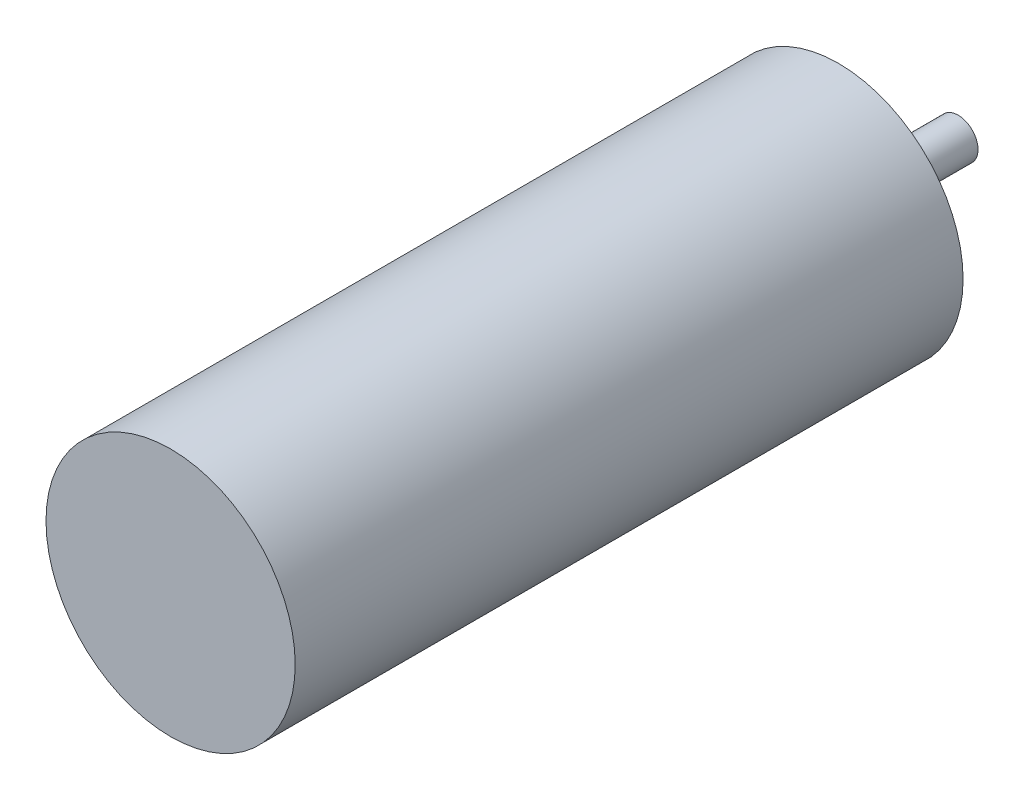
ISO-10303-21;
HEADER;
FILE_DESCRIPTION(('STEP AP214'),'2;1');
FILE_NAME('part.step','',(''),(''),'','','');
FILE_SCHEMA(('AUTOMOTIVE_DESIGN { 1 0 10303 214 1 1 1 1 }'));
ENDSEC;
DATA;
#1=APPLICATION_CONTEXT('core data for automotive mechanical design processes');
#2=APPLICATION_PROTOCOL_DEFINITION('international standard','automotive_design',2000,#1);
#3=PRODUCT_CONTEXT('',#1,'mechanical');
#4=PRODUCT('Part','Part','',(#3));
#5=PRODUCT_RELATED_PRODUCT_CATEGORY('part','',(#4));
#6=PRODUCT_DEFINITION_FORMATION('','',#4);
#7=PRODUCT_DEFINITION_CONTEXT('part definition',#1,'design');
#8=PRODUCT_DEFINITION('design','',#6,#7);
#9=PRODUCT_DEFINITION_SHAPE('','',#8);
#10=(LENGTH_UNIT() NAMED_UNIT(*) SI_UNIT(.MILLI.,.METRE.));
#11=(NAMED_UNIT(*) PLANE_ANGLE_UNIT() SI_UNIT($,.RADIAN.));
#12=(NAMED_UNIT(*) SI_UNIT($,.STERADIAN.) SOLID_ANGLE_UNIT());
#13=UNCERTAINTY_MEASURE_WITH_UNIT(LENGTH_MEASURE(1.E-05),#10,'distance_accuracy_value','');
#14=(GEOMETRIC_REPRESENTATION_CONTEXT(3) GLOBAL_UNCERTAINTY_ASSIGNED_CONTEXT((#13)) GLOBAL_UNIT_ASSIGNED_CONTEXT((#10,
#11,#12)) REPRESENTATION_CONTEXT('',''));
#15=CARTESIAN_POINT('',(0.,0.,0.));
#16=DIRECTION('',(0.,0.,1.));
#17=DIRECTION('',(1.,0.,0.));
#18=AXIS2_PLACEMENT_3D('',#15,#16,#17);
#19=CARTESIAN_POINT('',(0.,0.,67.));
#20=DIRECTION('',(0.,0.,-1.));
#21=DIRECTION('',(-1.,0.,0.));
#22=AXIS2_PLACEMENT_3D('',#19,#20,#21);
#23=CYLINDRICAL_SURFACE('',#22,12.5);
#24=CARTESIAN_POINT('',(0.,0.,67.));
#25=DIRECTION('',(0.,0.,1.));
#26=DIRECTION('',(1.,0.,0.));
#27=AXIS2_PLACEMENT_3D('',#24,#25,#26);
#28=CIRCLE('',#27,12.5);
#29=CARTESIAN_POINT('',(12.5,0.,67.));
#30=VERTEX_POINT('',#29);
#31=EDGE_CURVE('E43',#30,#30,#28,.T.);
#32=ORIENTED_EDGE('',*,*,#31,.F.);
#33=EDGE_LOOP('',(#32));
#34=FACE_BOUND('',#33,.T.);
#35=CARTESIAN_POINT('',(0.,0.,0.));
#36=DIRECTION('',(0.,0.,1.));
#37=DIRECTION('',(1.,0.,0.));
#38=AXIS2_PLACEMENT_3D('',#35,#36,#37);
#39=CIRCLE('',#38,12.5);
#40=CARTESIAN_POINT('',(12.5,0.,0.));
#41=VERTEX_POINT('',#40);
#42=EDGE_CURVE('E34',#41,#41,#39,.T.);
#43=ORIENTED_EDGE('',*,*,#42,.T.);
#44=EDGE_LOOP('',(#43));
#45=FACE_BOUND('',#44,.T.);
#46=ADVANCED_FACE('F31',(#34,#45),#23,.T.);
#47=CARTESIAN_POINT('',(0.,0.,67.));
#48=DIRECTION('',(0.,0.,1.));
#49=DIRECTION('',(1.,0.,0.));
#50=AXIS2_PLACEMENT_3D('',#47,#48,#49);
#51=PLANE('',#50);
#52=ORIENTED_EDGE('',*,*,#31,.T.);
#53=EDGE_LOOP('',(#52));
#54=FACE_BOUND('',#53,.T.);
#55=ADVANCED_FACE('F60',(#54),#51,.T.);
#56=CARTESIAN_POINT('',(0.,0.,0.));
#57=DIRECTION('',(0.,0.,1.));
#58=DIRECTION('',(1.,0.,0.));
#59=AXIS2_PLACEMENT_3D('',#56,#57,#58);
#60=PLANE('',#59);
#61=CARTESIAN_POINT('',(0.,0.,0.));
#62=DIRECTION('',(0.,0.,-1.));
#63=DIRECTION('',(-1.,0.,0.));
#64=AXIS2_PLACEMENT_3D('',#61,#62,#63);
#65=CIRCLE('',#64,4.);
#66=CARTESIAN_POINT('',(-4.,0.,0.));
#67=VERTEX_POINT('',#66);
#68=EDGE_CURVE('E38',#67,#67,#65,.T.);
#69=ORIENTED_EDGE('',*,*,#68,.F.);
#70=EDGE_LOOP('',(#69));
#71=FACE_BOUND('',#70,.T.);
#72=ORIENTED_EDGE('',*,*,#42,.F.);
#73=EDGE_LOOP('',(#72));
#74=FACE_BOUND('',#73,.T.);
#75=ADVANCED_FACE('F57',(#71,#74),#60,.F.);
#76=CARTESIAN_POINT('',(0.,0.,-3.));
#77=DIRECTION('',(0.,0.,1.));
#78=DIRECTION('',(1.,0.,0.));
#79=AXIS2_PLACEMENT_3D('',#76,#77,#78);
#80=CYLINDRICAL_SURFACE('',#79,4.);
#81=CARTESIAN_POINT('',(0.,0.,-3.));
#82=DIRECTION('',(0.,0.,-1.));
#83=DIRECTION('',(-1.,0.,0.));
#84=AXIS2_PLACEMENT_3D('',#81,#82,#83);
#85=CIRCLE('',#84,4.);
#86=CARTESIAN_POINT('',(-4.,0.,-3.));
#87=VERTEX_POINT('',#86);
#88=EDGE_CURVE('E48',#87,#87,#85,.T.);
#89=ORIENTED_EDGE('',*,*,#88,.F.);
#90=EDGE_LOOP('',(#89));
#91=FACE_BOUND('',#90,.T.);
#92=ORIENTED_EDGE('',*,*,#68,.T.);
#93=EDGE_LOOP('',(#92));
#94=FACE_BOUND('',#93,.T.);
#95=ADVANCED_FACE('F59',(#91,#94),#80,.T.);
#96=CARTESIAN_POINT('',(0.,0.,-3.));
#97=DIRECTION('',(0.,0.,-1.));
#98=DIRECTION('',(-1.,0.,0.));
#99=AXIS2_PLACEMENT_3D('',#96,#97,#98);
#100=PLANE('',#99);
#101=CARTESIAN_POINT('',(0.,0.,-3.));
#102=DIRECTION('',(0.,0.,-1.));
#103=DIRECTION('',(-1.,0.,0.));
#104=AXIS2_PLACEMENT_3D('',#101,#102,#103);
#105=CIRCLE('',#104,2.);
#106=CARTESIAN_POINT('',(-2.,0.,-3.));
#107=VERTEX_POINT('',#106);
#108=EDGE_CURVE('E10',#107,#107,#105,.T.);
#109=ORIENTED_EDGE('',*,*,#108,.F.);
#110=EDGE_LOOP('',(#109));
#111=FACE_BOUND('',#110,.T.);
#112=ORIENTED_EDGE('',*,*,#88,.T.);
#113=EDGE_LOOP('',(#112));
#114=FACE_BOUND('',#113,.T.);
#115=ADVANCED_FACE('F66',(#111,#114),#100,.T.);
#116=CARTESIAN_POINT('',(0.,0.,-12.));
#117=DIRECTION('',(0.,0.,1.));
#118=DIRECTION('',(1.,0.,0.));
#119=AXIS2_PLACEMENT_3D('',#116,#117,#118);
#120=CYLINDRICAL_SURFACE('',#119,2.);
#121=CARTESIAN_POINT('',(0.,0.,-12.));
#122=DIRECTION('',(0.,0.,-1.));
#123=DIRECTION('',(-1.,0.,0.));
#124=AXIS2_PLACEMENT_3D('',#121,#122,#123);
#125=CIRCLE('',#124,2.);
#126=CARTESIAN_POINT('',(-2.,0.,-12.));
#127=VERTEX_POINT('',#126);
#128=EDGE_CURVE('E47',#127,#127,#125,.T.);
#129=ORIENTED_EDGE('',*,*,#128,.F.);
#130=EDGE_LOOP('',(#129));
#131=FACE_BOUND('',#130,.T.);
#132=ORIENTED_EDGE('',*,*,#108,.T.);
#133=EDGE_LOOP('',(#132));
#134=FACE_BOUND('',#133,.T.);
#135=ADVANCED_FACE('F98',(#131,#134),#120,.T.);
#136=CARTESIAN_POINT('',(0.,0.,-12.));
#137=DIRECTION('',(0.,0.,-1.));
#138=DIRECTION('',(-1.,0.,0.));
#139=AXIS2_PLACEMENT_3D('',#136,#137,#138);
#140=PLANE('',#139);
#141=ORIENTED_EDGE('',*,*,#128,.T.);
#142=EDGE_LOOP('',(#141));
#143=FACE_BOUND('',#142,.T.);
#144=ADVANCED_FACE('F108',(#143),#140,.T.);
#145=CLOSED_SHELL('',(#46,#55,#75,#95,#115,#135,#144));
#146=MANIFOLD_SOLID_BREP('B2',#145);
#147=ADVANCED_BREP_SHAPE_REPRESENTATION('',(#18,#146),#14);
#148=SHAPE_DEFINITION_REPRESENTATION(#9,#147);
ENDSEC;
END-ISO-10303-21;
